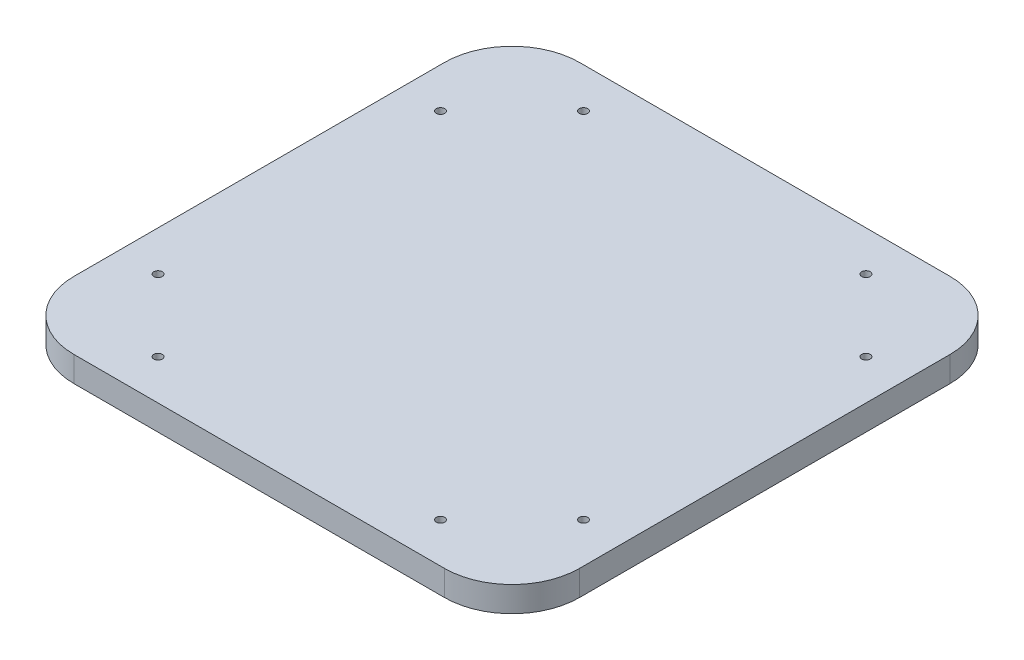
ISO-10303-21;
HEADER;
FILE_DESCRIPTION(('STEP AP214'),'2;1');
FILE_NAME('part.step','',(''),(''),'','','');
FILE_SCHEMA(('AUTOMOTIVE_DESIGN { 1 0 10303 214 1 1 1 1 }'));
ENDSEC;
DATA;
#1=APPLICATION_CONTEXT('core data for automotive mechanical design processes');
#2=APPLICATION_PROTOCOL_DEFINITION('international standard','automotive_design',2000,#1);
#3=PRODUCT_CONTEXT('',#1,'mechanical');
#4=PRODUCT('Part','Part','',(#3));
#5=PRODUCT_RELATED_PRODUCT_CATEGORY('part','',(#4));
#6=PRODUCT_DEFINITION_FORMATION('','',#4);
#7=PRODUCT_DEFINITION_CONTEXT('part definition',#1,'design');
#8=PRODUCT_DEFINITION('design','',#6,#7);
#9=PRODUCT_DEFINITION_SHAPE('','',#8);
#10=(LENGTH_UNIT() NAMED_UNIT(*) SI_UNIT(.MILLI.,.METRE.));
#11=(NAMED_UNIT(*) PLANE_ANGLE_UNIT() SI_UNIT($,.RADIAN.));
#12=(NAMED_UNIT(*) SI_UNIT($,.STERADIAN.) SOLID_ANGLE_UNIT());
#13=UNCERTAINTY_MEASURE_WITH_UNIT(LENGTH_MEASURE(1.E-05),#10,'distance_accuracy_value','');
#14=(GEOMETRIC_REPRESENTATION_CONTEXT(3) GLOBAL_UNCERTAINTY_ASSIGNED_CONTEXT((#13)) GLOBAL_UNIT_ASSIGNED_CONTEXT((#10,
#11,#12)) REPRESENTATION_CONTEXT('',''));
#15=CARTESIAN_POINT('',(0.,0.,0.));
#16=DIRECTION('',(0.,0.,1.));
#17=DIRECTION('',(1.,0.,0.));
#18=AXIS2_PLACEMENT_3D('',#15,#16,#17);
#19=CARTESIAN_POINT('',(150.,15.,150.));
#20=DIRECTION('',(-1.,0.,0.));
#21=DIRECTION('',(0.,0.,1.));
#22=AXIS2_PLACEMENT_3D('',#19,#20,#21);
#23=PLANE('',#22);
#24=DIRECTION('',(0.,0.,-1.));
#25=VECTOR('',#24,1.);
#26=CARTESIAN_POINT('',(150.,15.,150.));
#27=LINE('',#26,#25);
#28=CARTESIAN_POINT('',(150.,15.,110.));
#29=VERTEX_POINT('',#28);
#30=CARTESIAN_POINT('',(150.,15.,-110.));
#31=VERTEX_POINT('',#30);
#32=EDGE_CURVE('E132',#29,#31,#27,.T.);
#33=ORIENTED_EDGE('',*,*,#32,.F.);
#34=DIRECTION('',(0.,-1.,0.));
#35=VECTOR('',#34,1.);
#36=CARTESIAN_POINT('',(150.,15.,110.));
#37=LINE('',#36,#35);
#38=CARTESIAN_POINT('',(150.,0.,110.));
#39=VERTEX_POINT('',#38);
#40=EDGE_CURVE('E11',#29,#39,#37,.T.);
#41=ORIENTED_EDGE('',*,*,#40,.T.);
#42=DIRECTION('',(0.,0.,-1.));
#43=VECTOR('',#42,1.);
#44=CARTESIAN_POINT('',(150.,0.,150.));
#45=LINE('',#44,#43);
#46=CARTESIAN_POINT('',(150.,0.,-110.));
#47=VERTEX_POINT('',#46);
#48=EDGE_CURVE('E163',#39,#47,#45,.T.);
#49=ORIENTED_EDGE('',*,*,#48,.T.);
#50=DIRECTION('',(0.,-1.,0.));
#51=VECTOR('',#50,1.);
#52=CARTESIAN_POINT('',(150.,15.,-110.));
#53=LINE('',#52,#51);
#54=EDGE_CURVE('E46',#47,#31,#53,.F.);
#55=ORIENTED_EDGE('',*,*,#54,.T.);
#56=EDGE_LOOP('',(#33,#41,#49,#55));
#57=FACE_BOUND('',#56,.T.);
#58=ADVANCED_FACE('F38',(#57),#23,.F.);
#59=CARTESIAN_POINT('',(-150.,15.,-150.));
#60=DIRECTION('',(0.,0.,1.));
#61=DIRECTION('',(1.,0.,0.));
#62=AXIS2_PLACEMENT_3D('',#59,#60,#61);
#63=PLANE('',#62);
#64=DIRECTION('',(-1.,0.,0.));
#65=VECTOR('',#64,1.);
#66=CARTESIAN_POINT('',(-150.,0.,-150.));
#67=LINE('',#66,#65);
#68=CARTESIAN_POINT('',(110.,0.,-150.));
#69=VERTEX_POINT('',#68);
#70=CARTESIAN_POINT('',(-110.,0.,-150.));
#71=VERTEX_POINT('',#70);
#72=EDGE_CURVE('E137',#69,#71,#67,.T.);
#73=ORIENTED_EDGE('',*,*,#72,.T.);
#74=DIRECTION('',(0.,-1.,0.));
#75=VECTOR('',#74,1.);
#76=CARTESIAN_POINT('',(-110.,15.,-150.));
#77=LINE('',#76,#75);
#78=CARTESIAN_POINT('',(-110.,15.,-150.));
#79=VERTEX_POINT('',#78);
#80=EDGE_CURVE('E53',#71,#79,#77,.F.);
#81=ORIENTED_EDGE('',*,*,#80,.T.);
#82=DIRECTION('',(-1.,0.,0.));
#83=VECTOR('',#82,1.);
#84=CARTESIAN_POINT('',(-150.,15.,-150.));
#85=LINE('',#84,#83);
#86=CARTESIAN_POINT('',(110.,15.,-150.));
#87=VERTEX_POINT('',#86);
#88=EDGE_CURVE('E135',#87,#79,#85,.T.);
#89=ORIENTED_EDGE('',*,*,#88,.F.);
#90=DIRECTION('',(0.,-1.,0.));
#91=VECTOR('',#90,1.);
#92=CARTESIAN_POINT('',(110.,15.,-150.));
#93=LINE('',#92,#91);
#94=EDGE_CURVE('E155',#87,#69,#93,.T.);
#95=ORIENTED_EDGE('',*,*,#94,.T.);
#96=EDGE_LOOP('',(#73,#81,#89,#95));
#97=FACE_BOUND('',#96,.T.);
#98=ADVANCED_FACE('F170',(#97),#63,.F.);
#99=CARTESIAN_POINT('',(-150.,15.,150.));
#100=DIRECTION('',(1.,0.,0.));
#101=DIRECTION('',(0.,0.,-1.));
#102=AXIS2_PLACEMENT_3D('',#99,#100,#101);
#103=PLANE('',#102);
#104=DIRECTION('',(0.,0.,1.));
#105=VECTOR('',#104,1.);
#106=CARTESIAN_POINT('',(-150.,0.,150.));
#107=LINE('',#106,#105);
#108=CARTESIAN_POINT('',(-150.,0.,-110.));
#109=VERTEX_POINT('',#108);
#110=CARTESIAN_POINT('',(-150.,0.,110.));
#111=VERTEX_POINT('',#110);
#112=EDGE_CURVE('E133',#109,#111,#107,.T.);
#113=ORIENTED_EDGE('',*,*,#112,.T.);
#114=DIRECTION('',(0.,-1.,0.));
#115=VECTOR('',#114,1.);
#116=CARTESIAN_POINT('',(-150.,15.,110.));
#117=LINE('',#116,#115);
#118=CARTESIAN_POINT('',(-150.,15.,110.));
#119=VERTEX_POINT('',#118);
#120=EDGE_CURVE('E110',#111,#119,#117,.F.);
#121=ORIENTED_EDGE('',*,*,#120,.T.);
#122=DIRECTION('',(0.,0.,1.));
#123=VECTOR('',#122,1.);
#124=CARTESIAN_POINT('',(-150.,15.,150.));
#125=LINE('',#124,#123);
#126=CARTESIAN_POINT('',(-150.,15.,-110.));
#127=VERTEX_POINT('',#126);
#128=EDGE_CURVE('E175',#127,#119,#125,.T.);
#129=ORIENTED_EDGE('',*,*,#128,.F.);
#130=DIRECTION('',(0.,-1.,0.));
#131=VECTOR('',#130,1.);
#132=CARTESIAN_POINT('',(-150.,15.,-110.));
#133=LINE('',#132,#131);
#134=EDGE_CURVE('E115',#127,#109,#133,.T.);
#135=ORIENTED_EDGE('',*,*,#134,.T.);
#136=EDGE_LOOP('',(#113,#121,#129,#135));
#137=FACE_BOUND('',#136,.T.);
#138=ADVANCED_FACE('F266',(#137),#103,.F.);
#139=CARTESIAN_POINT('',(-150.,15.,150.));
#140=DIRECTION('',(0.,0.,-1.));
#141=DIRECTION('',(-1.,0.,0.));
#142=AXIS2_PLACEMENT_3D('',#139,#140,#141);
#143=PLANE('',#142);
#144=DIRECTION('',(1.,0.,0.));
#145=VECTOR('',#144,1.);
#146=CARTESIAN_POINT('',(-150.,15.,150.));
#147=LINE('',#146,#145);
#148=CARTESIAN_POINT('',(-110.,15.,150.));
#149=VERTEX_POINT('',#148);
#150=CARTESIAN_POINT('',(110.,15.,150.));
#151=VERTEX_POINT('',#150);
#152=EDGE_CURVE('E125',#149,#151,#147,.T.);
#153=ORIENTED_EDGE('',*,*,#152,.F.);
#154=DIRECTION('',(0.,-1.,0.));
#155=VECTOR('',#154,1.);
#156=CARTESIAN_POINT('',(-110.,15.,150.));
#157=LINE('',#156,#155);
#158=CARTESIAN_POINT('',(-110.,0.,150.));
#159=VERTEX_POINT('',#158);
#160=EDGE_CURVE('E109',#149,#159,#157,.T.);
#161=ORIENTED_EDGE('',*,*,#160,.T.);
#162=DIRECTION('',(1.,0.,0.));
#163=VECTOR('',#162,1.);
#164=CARTESIAN_POINT('',(-150.,0.,150.));
#165=LINE('',#164,#163);
#166=CARTESIAN_POINT('',(110.,0.,150.));
#167=VERTEX_POINT('',#166);
#168=EDGE_CURVE('E122',#159,#167,#165,.T.);
#169=ORIENTED_EDGE('',*,*,#168,.T.);
#170=DIRECTION('',(0.,-1.,0.));
#171=VECTOR('',#170,1.);
#172=CARTESIAN_POINT('',(110.,15.,150.));
#173=LINE('',#172,#171);
#174=EDGE_CURVE('E127',#167,#151,#173,.F.);
#175=ORIENTED_EDGE('',*,*,#174,.T.);
#176=EDGE_LOOP('',(#153,#161,#169,#175));
#177=FACE_BOUND('',#176,.T.);
#178=ADVANCED_FACE('F121',(#177),#143,.F.);
#179=CARTESIAN_POINT('',(0.,15.,0.));
#180=DIRECTION('',(0.,-1.,0.));
#181=DIRECTION('',(0.,0.,-1.));
#182=AXIS2_PLACEMENT_3D('',#179,#180,#181);
#183=PLANE('',#182);
#184=CARTESIAN_POINT('',(83.7867965644036,15.,126.213203435596));
#185=DIRECTION('',(0.,1.,0.));
#186=DIRECTION('',(0.,0.,1.));
#187=AXIS2_PLACEMENT_3D('',#184,#185,#186);
#188=CIRCLE('',#187,2.50000000000001);
#189=CARTESIAN_POINT('',(83.7867965644036,15.,128.713203435596));
#190=VERTEX_POINT('',#189);
#191=EDGE_CURVE('E196',#190,#190,#188,.T.);
#192=ORIENTED_EDGE('',*,*,#191,.F.);
#193=EDGE_LOOP('',(#192));
#194=FACE_BOUND('',#193,.T.);
#195=CARTESIAN_POINT('',(83.7867965644035,15.,-126.213203435596));
#196=DIRECTION('',(0.,1.,0.));
#197=DIRECTION('',(0.,0.,1.));
#198=AXIS2_PLACEMENT_3D('',#195,#196,#197);
#199=CIRCLE('',#198,2.5);
#200=CARTESIAN_POINT('',(83.7867965644035,15.,-123.713203435596));
#201=VERTEX_POINT('',#200);
#202=EDGE_CURVE('E203',#201,#201,#199,.T.);
#203=ORIENTED_EDGE('',*,*,#202,.F.);
#204=EDGE_LOOP('',(#203));
#205=FACE_BOUND('',#204,.T.);
#206=CARTESIAN_POINT('',(126.213203435596,15.,-83.7867965644036));
#207=DIRECTION('',(0.,1.,0.));
#208=DIRECTION('',(0.,0.,1.));
#209=AXIS2_PLACEMENT_3D('',#206,#207,#208);
#210=CIRCLE('',#209,2.49999999999997);
#211=CARTESIAN_POINT('',(126.213203435596,15.,-81.2867965644036));
#212=VERTEX_POINT('',#211);
#213=EDGE_CURVE('E184',#212,#212,#210,.T.);
#214=ORIENTED_EDGE('',*,*,#213,.F.);
#215=EDGE_LOOP('',(#214));
#216=FACE_BOUND('',#215,.T.);
#217=CARTESIAN_POINT('',(-126.213203435596,15.,-83.7867965644036));
#218=DIRECTION('',(0.,1.,0.));
#219=DIRECTION('',(0.,0.,1.));
#220=AXIS2_PLACEMENT_3D('',#217,#218,#219);
#221=CIRCLE('',#220,2.5);
#222=CARTESIAN_POINT('',(-126.213203435596,15.,-81.2867965644036));
#223=VERTEX_POINT('',#222);
#224=EDGE_CURVE('E191',#223,#223,#221,.T.);
#225=ORIENTED_EDGE('',*,*,#224,.F.);
#226=EDGE_LOOP('',(#225));
#227=FACE_BOUND('',#226,.T.);
#228=CARTESIAN_POINT('',(126.213203435596,15.,83.7867965644035));
#229=DIRECTION('',(0.,1.,0.));
#230=DIRECTION('',(0.,0.,1.));
#231=AXIS2_PLACEMENT_3D('',#228,#229,#230);
#232=CIRCLE('',#231,2.5);
#233=CARTESIAN_POINT('',(126.213203435596,15.,86.2867965644035));
#234=VERTEX_POINT('',#233);
#235=EDGE_CURVE('E220',#234,#234,#232,.T.);
#236=ORIENTED_EDGE('',*,*,#235,.F.);
#237=EDGE_LOOP('',(#236));
#238=FACE_BOUND('',#237,.T.);
#239=CARTESIAN_POINT('',(-126.213203435596,15.,83.7867965644036));
#240=DIRECTION('',(0.,1.,0.));
#241=DIRECTION('',(0.,0.,1.));
#242=AXIS2_PLACEMENT_3D('',#239,#240,#241);
#243=CIRCLE('',#242,2.5);
#244=CARTESIAN_POINT('',(-126.213203435596,15.,86.2867965644036));
#245=VERTEX_POINT('',#244);
#246=EDGE_CURVE('E214',#245,#245,#243,.T.);
#247=ORIENTED_EDGE('',*,*,#246,.F.);
#248=EDGE_LOOP('',(#247));
#249=FACE_BOUND('',#248,.T.);
#250=CARTESIAN_POINT('',(-83.7867965644035,15.,126.213203435596));
#251=DIRECTION('',(0.,1.,0.));
#252=DIRECTION('',(0.,0.,1.));
#253=AXIS2_PLACEMENT_3D('',#250,#251,#252);
#254=CIRCLE('',#253,2.50000000000001);
#255=CARTESIAN_POINT('',(-83.7867965644035,15.,128.713203435596));
#256=VERTEX_POINT('',#255);
#257=EDGE_CURVE('E208',#256,#256,#254,.T.);
#258=ORIENTED_EDGE('',*,*,#257,.F.);
#259=EDGE_LOOP('',(#258));
#260=FACE_BOUND('',#259,.T.);
#261=CARTESIAN_POINT('',(-83.7867965644036,15.,-126.213203435596));
#262=DIRECTION('',(0.,1.,0.));
#263=DIRECTION('',(0.,0.,1.));
#264=AXIS2_PLACEMENT_3D('',#261,#262,#263);
#265=CIRCLE('',#264,2.5);
#266=CARTESIAN_POINT('',(-83.7867965644036,15.,-123.713203435596));
#267=VERTEX_POINT('',#266);
#268=EDGE_CURVE('E178',#267,#267,#265,.T.);
#269=ORIENTED_EDGE('',*,*,#268,.F.);
#270=EDGE_LOOP('',(#269));
#271=FACE_BOUND('',#270,.T.);
#272=ORIENTED_EDGE('',*,*,#128,.T.);
#273=CARTESIAN_POINT('',(-110.,15.,110.));
#274=DIRECTION('',(0.,-1.,0.));
#275=DIRECTION('',(0.,0.,-1.));
#276=AXIS2_PLACEMENT_3D('',#273,#274,#275);
#277=CIRCLE('',#276,40.);
#278=EDGE_CURVE('E153',#119,#149,#277,.F.);
#279=ORIENTED_EDGE('',*,*,#278,.T.);
#280=ORIENTED_EDGE('',*,*,#152,.T.);
#281=CARTESIAN_POINT('',(110.,15.,110.));
#282=DIRECTION('',(0.,-1.,0.));
#283=DIRECTION('',(0.,0.,-1.));
#284=AXIS2_PLACEMENT_3D('',#281,#282,#283);
#285=CIRCLE('',#284,40.);
#286=EDGE_CURVE('E149',#151,#29,#285,.F.);
#287=ORIENTED_EDGE('',*,*,#286,.T.);
#288=ORIENTED_EDGE('',*,*,#32,.T.);
#289=CARTESIAN_POINT('',(110.,15.,-110.));
#290=DIRECTION('',(0.,-1.,0.));
#291=DIRECTION('',(0.,0.,-1.));
#292=AXIS2_PLACEMENT_3D('',#289,#290,#291);
#293=CIRCLE('',#292,40.);
#294=EDGE_CURVE('E60',#31,#87,#293,.F.);
#295=ORIENTED_EDGE('',*,*,#294,.T.);
#296=ORIENTED_EDGE('',*,*,#88,.T.);
#297=CARTESIAN_POINT('',(-110.,15.,-110.));
#298=DIRECTION('',(0.,-1.,0.));
#299=DIRECTION('',(0.,0.,-1.));
#300=AXIS2_PLACEMENT_3D('',#297,#298,#299);
#301=CIRCLE('',#300,40.);
#302=EDGE_CURVE('E151',#79,#127,#301,.F.);
#303=ORIENTED_EDGE('',*,*,#302,.T.);
#304=EDGE_LOOP('',(#272,#279,#280,#287,#288,#295,#296,#303));
#305=FACE_BOUND('',#304,.T.);
#306=ADVANCED_FACE('F166',(#194,#205,#216,#227,#238,#249,#260,#271,#305),#183,.F.);
#307=CARTESIAN_POINT('',(0.,0.,0.));
#308=DIRECTION('',(0.,-1.,0.));
#309=DIRECTION('',(0.,0.,-1.));
#310=AXIS2_PLACEMENT_3D('',#307,#308,#309);
#311=PLANE('',#310);
#312=CARTESIAN_POINT('',(83.7867965644036,0.,126.213203435596));
#313=DIRECTION('',(0.,1.,0.));
#314=DIRECTION('',(0.,0.,1.));
#315=AXIS2_PLACEMENT_3D('',#312,#313,#314);
#316=CIRCLE('',#315,2.50000000000001);
#317=CARTESIAN_POINT('',(83.7867965644036,0.,128.713203435596));
#318=VERTEX_POINT('',#317);
#319=EDGE_CURVE('E199',#318,#318,#316,.T.);
#320=ORIENTED_EDGE('',*,*,#319,.T.);
#321=EDGE_LOOP('',(#320));
#322=FACE_BOUND('',#321,.T.);
#323=CARTESIAN_POINT('',(83.7867965644035,0.,-126.213203435596));
#324=DIRECTION('',(0.,1.,0.));
#325=DIRECTION('',(0.,0.,1.));
#326=AXIS2_PLACEMENT_3D('',#323,#324,#325);
#327=CIRCLE('',#326,2.5);
#328=CARTESIAN_POINT('',(83.7867965644035,0.,-123.713203435596));
#329=VERTEX_POINT('',#328);
#330=EDGE_CURVE('E188',#329,#329,#327,.T.);
#331=ORIENTED_EDGE('',*,*,#330,.T.);
#332=EDGE_LOOP('',(#331));
#333=FACE_BOUND('',#332,.T.);
#334=CARTESIAN_POINT('',(126.213203435596,0.,-83.7867965644036));
#335=DIRECTION('',(0.,1.,0.));
#336=DIRECTION('',(0.,0.,1.));
#337=AXIS2_PLACEMENT_3D('',#334,#335,#336);
#338=CIRCLE('',#337,2.49999999999997);
#339=CARTESIAN_POINT('',(126.213203435596,0.,-81.2867965644036));
#340=VERTEX_POINT('',#339);
#341=EDGE_CURVE('E187',#340,#340,#338,.T.);
#342=ORIENTED_EDGE('',*,*,#341,.T.);
#343=EDGE_LOOP('',(#342));
#344=FACE_BOUND('',#343,.T.);
#345=CARTESIAN_POINT('',(-126.213203435596,0.,-83.7867965644036));
#346=DIRECTION('',(0.,1.,0.));
#347=DIRECTION('',(0.,0.,1.));
#348=AXIS2_PLACEMENT_3D('',#345,#346,#347);
#349=CIRCLE('',#348,2.5);
#350=CARTESIAN_POINT('',(-126.213203435596,0.,-81.2867965644036));
#351=VERTEX_POINT('',#350);
#352=EDGE_CURVE('E181',#351,#351,#349,.T.);
#353=ORIENTED_EDGE('',*,*,#352,.T.);
#354=EDGE_LOOP('',(#353));
#355=FACE_BOUND('',#354,.T.);
#356=CARTESIAN_POINT('',(126.213203435596,0.,83.7867965644035));
#357=DIRECTION('',(0.,1.,0.));
#358=DIRECTION('',(0.,0.,1.));
#359=AXIS2_PLACEMENT_3D('',#356,#357,#358);
#360=CIRCLE('',#359,2.5);
#361=CARTESIAN_POINT('',(126.213203435596,0.,86.2867965644035));
#362=VERTEX_POINT('',#361);
#363=EDGE_CURVE('E200',#362,#362,#360,.T.);
#364=ORIENTED_EDGE('',*,*,#363,.T.);
#365=EDGE_LOOP('',(#364));
#366=FACE_BOUND('',#365,.T.);
#367=CARTESIAN_POINT('',(-126.213203435596,0.,83.7867965644036));
#368=DIRECTION('',(0.,1.,0.));
#369=DIRECTION('',(0.,0.,1.));
#370=AXIS2_PLACEMENT_3D('',#367,#368,#369);
#371=CIRCLE('',#370,2.5);
#372=CARTESIAN_POINT('',(-126.213203435596,0.,86.2867965644036));
#373=VERTEX_POINT('',#372);
#374=EDGE_CURVE('E217',#373,#373,#371,.T.);
#375=ORIENTED_EDGE('',*,*,#374,.T.);
#376=EDGE_LOOP('',(#375));
#377=FACE_BOUND('',#376,.T.);
#378=CARTESIAN_POINT('',(-83.7867965644035,0.,126.213203435596));
#379=DIRECTION('',(0.,1.,0.));
#380=DIRECTION('',(0.,0.,1.));
#381=AXIS2_PLACEMENT_3D('',#378,#379,#380);
#382=CIRCLE('',#381,2.50000000000001);
#383=CARTESIAN_POINT('',(-83.7867965644035,0.,128.713203435596));
#384=VERTEX_POINT('',#383);
#385=EDGE_CURVE('E211',#384,#384,#382,.T.);
#386=ORIENTED_EDGE('',*,*,#385,.T.);
#387=EDGE_LOOP('',(#386));
#388=FACE_BOUND('',#387,.T.);
#389=CARTESIAN_POINT('',(-83.7867965644036,0.,-126.213203435596));
#390=DIRECTION('',(0.,1.,0.));
#391=DIRECTION('',(0.,0.,1.));
#392=AXIS2_PLACEMENT_3D('',#389,#390,#391);
#393=CIRCLE('',#392,2.5);
#394=CARTESIAN_POINT('',(-83.7867965644036,0.,-123.713203435596));
#395=VERTEX_POINT('',#394);
#396=EDGE_CURVE('E171',#395,#395,#393,.T.);
#397=ORIENTED_EDGE('',*,*,#396,.T.);
#398=EDGE_LOOP('',(#397));
#399=FACE_BOUND('',#398,.T.);
#400=ORIENTED_EDGE('',*,*,#168,.F.);
#401=CARTESIAN_POINT('',(-110.,0.,110.));
#402=DIRECTION('',(0.,-1.,0.));
#403=DIRECTION('',(0.,0.,-1.));
#404=AXIS2_PLACEMENT_3D('',#401,#402,#403);
#405=CIRCLE('',#404,40.);
#406=EDGE_CURVE('E105',#159,#111,#405,.T.);
#407=ORIENTED_EDGE('',*,*,#406,.T.);
#408=ORIENTED_EDGE('',*,*,#112,.F.);
#409=CARTESIAN_POINT('',(-110.,0.,-110.));
#410=DIRECTION('',(0.,-1.,0.));
#411=DIRECTION('',(0.,0.,-1.));
#412=AXIS2_PLACEMENT_3D('',#409,#410,#411);
#413=CIRCLE('',#412,40.);
#414=EDGE_CURVE('E116',#109,#71,#413,.T.);
#415=ORIENTED_EDGE('',*,*,#414,.T.);
#416=ORIENTED_EDGE('',*,*,#72,.F.);
#417=CARTESIAN_POINT('',(110.,0.,-110.));
#418=DIRECTION('',(0.,-1.,0.));
#419=DIRECTION('',(0.,0.,-1.));
#420=AXIS2_PLACEMENT_3D('',#417,#418,#419);
#421=CIRCLE('',#420,40.);
#422=EDGE_CURVE('E126',#69,#47,#421,.T.);
#423=ORIENTED_EDGE('',*,*,#422,.T.);
#424=ORIENTED_EDGE('',*,*,#48,.F.);
#425=CARTESIAN_POINT('',(110.,0.,110.));
#426=DIRECTION('',(0.,-1.,0.));
#427=DIRECTION('',(0.,0.,-1.));
#428=AXIS2_PLACEMENT_3D('',#425,#426,#427);
#429=CIRCLE('',#428,40.);
#430=EDGE_CURVE('E131',#39,#167,#429,.T.);
#431=ORIENTED_EDGE('',*,*,#430,.T.);
#432=EDGE_LOOP('',(#400,#407,#408,#415,#416,#423,#424,#431));
#433=FACE_BOUND('',#432,.T.);
#434=ADVANCED_FACE('F129',(#322,#333,#344,#355,#366,#377,#388,#399,#433),#311,.T.);
#435=CARTESIAN_POINT('',(-83.7867965644036,0.,-126.213203435596));
#436=DIRECTION('',(0.,1.,0.));
#437=DIRECTION('',(0.,0.,1.));
#438=AXIS2_PLACEMENT_3D('',#435,#436,#437);
#439=CYLINDRICAL_SURFACE('',#438,2.5);
#440=ORIENTED_EDGE('',*,*,#396,.F.);
#441=EDGE_LOOP('',(#440));
#442=FACE_BOUND('',#441,.T.);
#443=ORIENTED_EDGE('',*,*,#268,.T.);
#444=EDGE_LOOP('',(#443));
#445=FACE_BOUND('',#444,.T.);
#446=ADVANCED_FACE('F246',(#442,#445),#439,.F.);
#447=CARTESIAN_POINT('',(-83.7867965644035,0.,126.213203435596));
#448=DIRECTION('',(0.,1.,0.));
#449=DIRECTION('',(0.,0.,1.));
#450=AXIS2_PLACEMENT_3D('',#447,#448,#449);
#451=CYLINDRICAL_SURFACE('',#450,2.50000000000001);
#452=ORIENTED_EDGE('',*,*,#385,.F.);
#453=EDGE_LOOP('',(#452));
#454=FACE_BOUND('',#453,.T.);
#455=ORIENTED_EDGE('',*,*,#257,.T.);
#456=EDGE_LOOP('',(#455));
#457=FACE_BOUND('',#456,.T.);
#458=ADVANCED_FACE('F248',(#454,#457),#451,.F.);
#459=CARTESIAN_POINT('',(-126.213203435596,0.,83.7867965644036));
#460=DIRECTION('',(0.,1.,0.));
#461=DIRECTION('',(0.,0.,1.));
#462=AXIS2_PLACEMENT_3D('',#459,#460,#461);
#463=CYLINDRICAL_SURFACE('',#462,2.5);
#464=ORIENTED_EDGE('',*,*,#374,.F.);
#465=EDGE_LOOP('',(#464));
#466=FACE_BOUND('',#465,.T.);
#467=ORIENTED_EDGE('',*,*,#246,.T.);
#468=EDGE_LOOP('',(#467));
#469=FACE_BOUND('',#468,.T.);
#470=ADVANCED_FACE('F232',(#466,#469),#463,.F.);
#471=CARTESIAN_POINT('',(126.213203435596,0.,83.7867965644035));
#472=DIRECTION('',(0.,1.,0.));
#473=DIRECTION('',(0.,0.,1.));
#474=AXIS2_PLACEMENT_3D('',#471,#472,#473);
#475=CYLINDRICAL_SURFACE('',#474,2.5);
#476=ORIENTED_EDGE('',*,*,#363,.F.);
#477=EDGE_LOOP('',(#476));
#478=FACE_BOUND('',#477,.T.);
#479=ORIENTED_EDGE('',*,*,#235,.T.);
#480=EDGE_LOOP('',(#479));
#481=FACE_BOUND('',#480,.T.);
#482=ADVANCED_FACE('F228',(#478,#481),#475,.F.);
#483=CARTESIAN_POINT('',(-126.213203435596,0.,-83.7867965644036));
#484=DIRECTION('',(0.,1.,0.));
#485=DIRECTION('',(0.,0.,1.));
#486=AXIS2_PLACEMENT_3D('',#483,#484,#485);
#487=CYLINDRICAL_SURFACE('',#486,2.5);
#488=ORIENTED_EDGE('',*,*,#352,.F.);
#489=EDGE_LOOP('',(#488));
#490=FACE_BOUND('',#489,.T.);
#491=ORIENTED_EDGE('',*,*,#224,.T.);
#492=EDGE_LOOP('',(#491));
#493=FACE_BOUND('',#492,.T.);
#494=ADVANCED_FACE('F231',(#490,#493),#487,.F.);
#495=CARTESIAN_POINT('',(126.213203435596,0.,-83.7867965644036));
#496=DIRECTION('',(0.,1.,0.));
#497=DIRECTION('',(0.,0.,1.));
#498=AXIS2_PLACEMENT_3D('',#495,#496,#497);
#499=CYLINDRICAL_SURFACE('',#498,2.49999999999997);
#500=ORIENTED_EDGE('',*,*,#341,.F.);
#501=EDGE_LOOP('',(#500));
#502=FACE_BOUND('',#501,.T.);
#503=ORIENTED_EDGE('',*,*,#213,.T.);
#504=EDGE_LOOP('',(#503));
#505=FACE_BOUND('',#504,.T.);
#506=ADVANCED_FACE('F340',(#502,#505),#499,.F.);
#507=CARTESIAN_POINT('',(83.7867965644035,0.,-126.213203435596));
#508=DIRECTION('',(0.,1.,0.));
#509=DIRECTION('',(0.,0.,1.));
#510=AXIS2_PLACEMENT_3D('',#507,#508,#509);
#511=CYLINDRICAL_SURFACE('',#510,2.5);
#512=ORIENTED_EDGE('',*,*,#330,.F.);
#513=EDGE_LOOP('',(#512));
#514=FACE_BOUND('',#513,.T.);
#515=ORIENTED_EDGE('',*,*,#202,.T.);
#516=EDGE_LOOP('',(#515));
#517=FACE_BOUND('',#516,.T.);
#518=ADVANCED_FACE('F333',(#514,#517),#511,.F.);
#519=CARTESIAN_POINT('',(83.7867965644036,0.,126.213203435596));
#520=DIRECTION('',(0.,1.,0.));
#521=DIRECTION('',(0.,0.,1.));
#522=AXIS2_PLACEMENT_3D('',#519,#520,#521);
#523=CYLINDRICAL_SURFACE('',#522,2.50000000000001);
#524=ORIENTED_EDGE('',*,*,#319,.F.);
#525=EDGE_LOOP('',(#524));
#526=FACE_BOUND('',#525,.T.);
#527=ORIENTED_EDGE('',*,*,#191,.T.);
#528=EDGE_LOOP('',(#527));
#529=FACE_BOUND('',#528,.T.);
#530=ADVANCED_FACE('F273',(#526,#529),#523,.F.);
#531=CARTESIAN_POINT('',(-110.,15.,110.));
#532=DIRECTION('',(0.,-1.,0.));
#533=DIRECTION('',(0.,0.,-1.));
#534=AXIS2_PLACEMENT_3D('',#531,#532,#533);
#535=CYLINDRICAL_SURFACE('',#534,40.);
#536=ORIENTED_EDGE('',*,*,#278,.F.);
#537=ORIENTED_EDGE('',*,*,#120,.F.);
#538=ORIENTED_EDGE('',*,*,#406,.F.);
#539=ORIENTED_EDGE('',*,*,#160,.F.);
#540=EDGE_LOOP('',(#536,#537,#538,#539));
#541=FACE_BOUND('',#540,.T.);
#542=ADVANCED_FACE('F108',(#541),#535,.T.);
#543=CARTESIAN_POINT('',(-110.,15.,-110.));
#544=DIRECTION('',(0.,-1.,0.));
#545=DIRECTION('',(0.,0.,-1.));
#546=AXIS2_PLACEMENT_3D('',#543,#544,#545);
#547=CYLINDRICAL_SURFACE('',#546,40.);
#548=ORIENTED_EDGE('',*,*,#302,.F.);
#549=ORIENTED_EDGE('',*,*,#80,.F.);
#550=ORIENTED_EDGE('',*,*,#414,.F.);
#551=ORIENTED_EDGE('',*,*,#134,.F.);
#552=EDGE_LOOP('',(#548,#549,#550,#551));
#553=FACE_BOUND('',#552,.T.);
#554=ADVANCED_FACE('F272',(#553),#547,.T.);
#555=CARTESIAN_POINT('',(110.,15.,110.));
#556=DIRECTION('',(0.,-1.,0.));
#557=DIRECTION('',(0.,0.,-1.));
#558=AXIS2_PLACEMENT_3D('',#555,#556,#557);
#559=CYLINDRICAL_SURFACE('',#558,40.);
#560=ORIENTED_EDGE('',*,*,#286,.F.);
#561=ORIENTED_EDGE('',*,*,#174,.F.);
#562=ORIENTED_EDGE('',*,*,#430,.F.);
#563=ORIENTED_EDGE('',*,*,#40,.F.);
#564=EDGE_LOOP('',(#560,#561,#562,#563));
#565=FACE_BOUND('',#564,.T.);
#566=ADVANCED_FACE('F275',(#565),#559,.T.);
#567=CARTESIAN_POINT('',(110.,15.,-110.));
#568=DIRECTION('',(0.,-1.,0.));
#569=DIRECTION('',(0.,0.,-1.));
#570=AXIS2_PLACEMENT_3D('',#567,#568,#569);
#571=CYLINDRICAL_SURFACE('',#570,40.);
#572=ORIENTED_EDGE('',*,*,#294,.F.);
#573=ORIENTED_EDGE('',*,*,#54,.F.);
#574=ORIENTED_EDGE('',*,*,#422,.F.);
#575=ORIENTED_EDGE('',*,*,#94,.F.);
#576=EDGE_LOOP('',(#572,#573,#574,#575));
#577=FACE_BOUND('',#576,.T.);
#578=ADVANCED_FACE('F40',(#577),#571,.T.);
#579=CLOSED_SHELL('',(#58,#98,#138,#178,#306,#434,#446,#458,#470,#482,#494,#506,#518,#530,#542,
#554,#566,#578));
#580=MANIFOLD_SOLID_BREP('B2',#579);
#581=ADVANCED_BREP_SHAPE_REPRESENTATION('',(#18,#580),#14);
#582=SHAPE_DEFINITION_REPRESENTATION(#9,#581);
ENDSEC;
END-ISO-10303-21;
